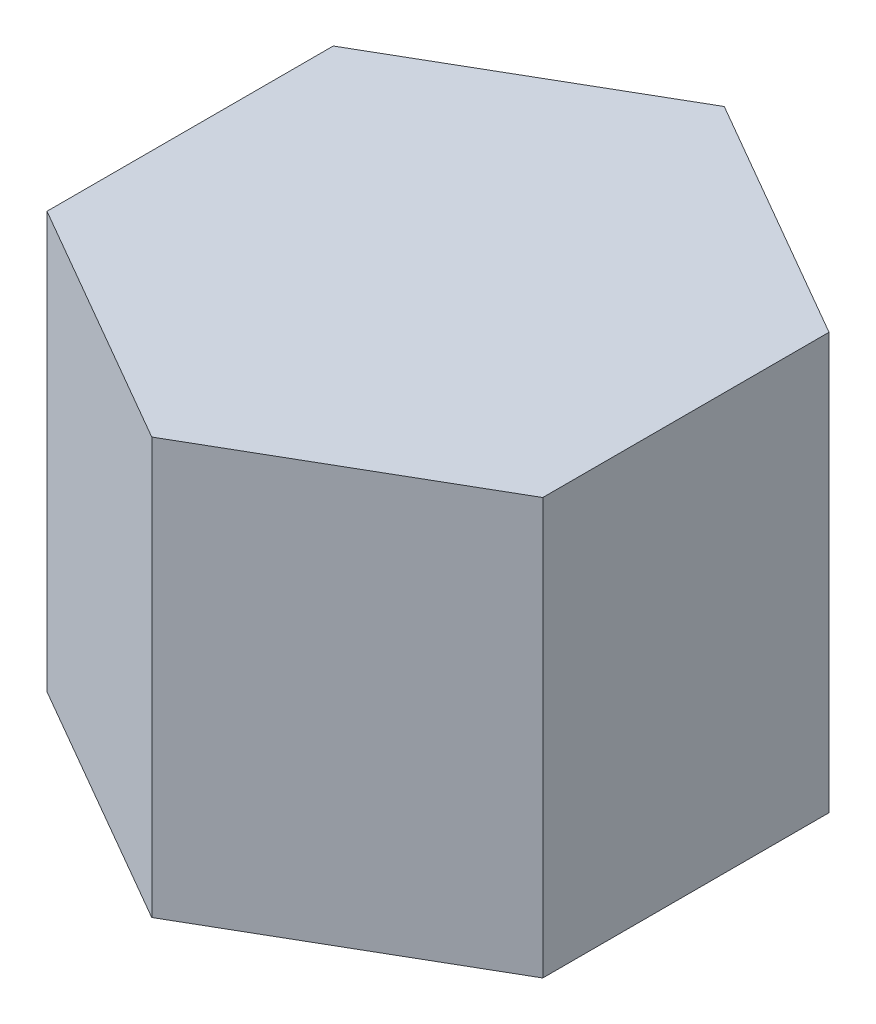
ISO-10303-21;
HEADER;
FILE_DESCRIPTION(('STEP AP214'),'2;1');
FILE_NAME('part.step','',(''),(''),'','','');
FILE_SCHEMA(('AUTOMOTIVE_DESIGN { 1 0 10303 214 1 1 1 1 }'));
ENDSEC;
DATA;
#1=APPLICATION_CONTEXT('core data for automotive mechanical design processes');
#2=APPLICATION_PROTOCOL_DEFINITION('international standard','automotive_design',2000,#1);
#3=PRODUCT_CONTEXT('',#1,'mechanical');
#4=PRODUCT('Part','Part','',(#3));
#5=PRODUCT_RELATED_PRODUCT_CATEGORY('part','',(#4));
#6=PRODUCT_DEFINITION_FORMATION('','',#4);
#7=PRODUCT_DEFINITION_CONTEXT('part definition',#1,'design');
#8=PRODUCT_DEFINITION('design','',#6,#7);
#9=PRODUCT_DEFINITION_SHAPE('','',#8);
#10=(LENGTH_UNIT() NAMED_UNIT(*) SI_UNIT(.MILLI.,.METRE.));
#11=(NAMED_UNIT(*) PLANE_ANGLE_UNIT() SI_UNIT($,.RADIAN.));
#12=(NAMED_UNIT(*) SI_UNIT($,.STERADIAN.) SOLID_ANGLE_UNIT());
#13=UNCERTAINTY_MEASURE_WITH_UNIT(LENGTH_MEASURE(1.E-05),#10,'distance_accuracy_value','');
#14=(GEOMETRIC_REPRESENTATION_CONTEXT(3) GLOBAL_UNCERTAINTY_ASSIGNED_CONTEXT((#13)) GLOBAL_UNIT_ASSIGNED_CONTEXT((#10,
#11,#12)) REPRESENTATION_CONTEXT('',''));
#15=CARTESIAN_POINT('',(0.,0.,0.));
#16=DIRECTION('',(0.,0.,1.));
#17=DIRECTION('',(1.,0.,0.));
#18=AXIS2_PLACEMENT_3D('',#15,#16,#17);
#19=CARTESIAN_POINT('',(210.839551417382,-147.556598747966,289.083895009141));
#20=DIRECTION('',(-0.499999999999978,0.,-0.866025403784452));
#21=DIRECTION('',(-0.866025403784452,0.,0.499999999999978));
#22=AXIS2_PLACEMENT_3D('',#19,#20,#21);
#23=PLANE('',#22);
#24=CARTESIAN_POINT('',(211.142660308706,-147.047793579175,288.908895009141));
#25=DIRECTION('',(-0.866025403784452,0.,0.499999999999978));
#26=VECTOR('',#25,1.);
#27=LINE('',#24,#26);
#28=CARTESIAN_POINT('',(211.142660308706,-147.047793579175,288.908895009141));
#29=VERTEX_POINT('',#28);
#30=CARTESIAN_POINT('',(210.839551417382,-147.047793579175,289.083895009141));
#31=VERTEX_POINT('',#30);
#32=EDGE_CURVE('E170',#29,#31,#27,.T.);
#33=ORIENTED_EDGE('',*,*,#32,.T.);
#34=CARTESIAN_POINT('',(210.839551417382,-147.556598747966,289.083895009141));
#35=DIRECTION('',(0.,1.,0.));
#36=VECTOR('',#35,1.);
#37=LINE('',#34,#36);
#38=CARTESIAN_POINT('',(210.839551417382,-147.556598747966,289.083895009141));
#39=VERTEX_POINT('',#38);
#40=EDGE_CURVE('E35',#39,#31,#37,.T.);
#41=ORIENTED_EDGE('',*,*,#40,.F.);
#42=CARTESIAN_POINT('',(211.142660308706,-147.556598747966,288.908895009141));
#43=DIRECTION('',(-0.866025403784452,0.,0.499999999999978));
#44=VECTOR('',#43,1.);
#45=LINE('',#42,#44);
#46=CARTESIAN_POINT('',(211.142660308706,-147.556598747966,288.908895009141));
#47=VERTEX_POINT('',#46);
#48=EDGE_CURVE('E159',#47,#39,#45,.T.);
#49=ORIENTED_EDGE('',*,*,#48,.F.);
#50=CARTESIAN_POINT('',(211.142660308706,-147.556598747966,288.908895009141));
#51=DIRECTION('',(0.,1.,0.));
#52=VECTOR('',#51,1.);
#53=LINE('',#50,#52);
#54=EDGE_CURVE('E10',#47,#29,#53,.T.);
#55=ORIENTED_EDGE('',*,*,#54,.T.);
#56=EDGE_LOOP('',(#33,#41,#49,#55));
#57=FACE_BOUND('',#56,.T.);
#58=ADVANCED_FACE('F16',(#57),#23,.F.);
#59=CARTESIAN_POINT('',(211.142660308706,-147.556598747966,291.594471220494));
#60=DIRECTION('',(-1.,0.,0.));
#61=DIRECTION('',(0.,-1.,0.));
#62=AXIS2_PLACEMENT_3D('',#59,#60,#61);
#63=PLANE('',#62);
#64=CARTESIAN_POINT('',(211.142660308706,-147.047793579175,288.558895009141));
#65=DIRECTION('',(0.,0.,1.));
#66=VECTOR('',#65,1.);
#67=LINE('',#64,#66);
#68=CARTESIAN_POINT('',(211.142660308706,-147.047793579175,288.558895009141));
#69=VERTEX_POINT('',#68);
#70=EDGE_CURVE('E167',#69,#29,#67,.T.);
#71=ORIENTED_EDGE('',*,*,#70,.T.);
#72=ORIENTED_EDGE('',*,*,#54,.F.);
#73=CARTESIAN_POINT('',(211.142660308706,-147.556598747966,288.558895009141));
#74=DIRECTION('',(0.,0.,1.));
#75=VECTOR('',#74,1.);
#76=LINE('',#73,#75);
#77=CARTESIAN_POINT('',(211.142660308706,-147.556598747966,288.558895009141));
#78=VERTEX_POINT('',#77);
#79=EDGE_CURVE('E156',#78,#47,#76,.T.);
#80=ORIENTED_EDGE('',*,*,#79,.F.);
#81=CARTESIAN_POINT('',(211.142660308706,-147.556598747966,288.558895009141));
#82=DIRECTION('',(0.,1.,0.));
#83=VECTOR('',#82,1.);
#84=LINE('',#81,#83);
#85=EDGE_CURVE('E27',#78,#69,#84,.T.);
#86=ORIENTED_EDGE('',*,*,#85,.T.);
#87=EDGE_LOOP('',(#71,#72,#80,#86));
#88=FACE_BOUND('',#87,.T.);
#89=ADVANCED_FACE('F189',(#88),#63,.F.);
#90=CARTESIAN_POINT('',(211.142660308706,-147.556598747966,288.558895009141));
#91=DIRECTION('',(-0.499999999999943,0.,0.866025403784471));
#92=DIRECTION('',(0.866025403784471,0.,0.499999999999943));
#93=AXIS2_PLACEMENT_3D('',#90,#91,#92);
#94=PLANE('',#93);
#95=CARTESIAN_POINT('',(210.839551417382,-147.047793579175,288.383895009141));
#96=DIRECTION('',(0.866025403784471,0.,0.499999999999943));
#97=VECTOR('',#96,1.);
#98=LINE('',#95,#97);
#99=CARTESIAN_POINT('',(210.839551417382,-147.047793579175,288.383895009141));
#100=VERTEX_POINT('',#99);
#101=EDGE_CURVE('E163',#100,#69,#98,.T.);
#102=ORIENTED_EDGE('',*,*,#101,.T.);
#103=ORIENTED_EDGE('',*,*,#85,.F.);
#104=CARTESIAN_POINT('',(210.839551417382,-147.556598747966,288.383895009141));
#105=DIRECTION('',(0.866025403784471,0.,0.499999999999943));
#106=VECTOR('',#105,1.);
#107=LINE('',#104,#106);
#108=CARTESIAN_POINT('',(210.839551417382,-147.556598747966,288.383895009141));
#109=VERTEX_POINT('',#108);
#110=EDGE_CURVE('E106',#109,#78,#107,.T.);
#111=ORIENTED_EDGE('',*,*,#110,.F.);
#112=CARTESIAN_POINT('',(210.839551417382,-147.556598747966,288.383895009141));
#113=DIRECTION('',(0.,1.,0.));
#114=VECTOR('',#113,1.);
#115=LINE('',#112,#114);
#116=EDGE_CURVE('E94',#109,#100,#115,.T.);
#117=ORIENTED_EDGE('',*,*,#116,.T.);
#118=EDGE_LOOP('',(#102,#103,#111,#117));
#119=FACE_BOUND('',#118,.T.);
#120=ADVANCED_FACE('F198',(#119),#94,.F.);
#121=CARTESIAN_POINT('',(210.839551417382,-147.556598747966,288.383895009141));
#122=DIRECTION('',(0.499999999999978,0.,0.866025403784452));
#123=DIRECTION('',(0.866025403784452,0.,-0.499999999999978));
#124=AXIS2_PLACEMENT_3D('',#121,#122,#123);
#125=PLANE('',#124);
#126=CARTESIAN_POINT('',(210.536442526057,-147.047793579175,288.558895009141));
#127=DIRECTION('',(0.866025403784452,0.,-0.499999999999978));
#128=VECTOR('',#127,1.);
#129=LINE('',#126,#128);
#130=CARTESIAN_POINT('',(210.536442526057,-147.047793579175,288.558895009141));
#131=VERTEX_POINT('',#130);
#132=EDGE_CURVE('E162',#131,#100,#129,.T.);
#133=ORIENTED_EDGE('',*,*,#132,.T.);
#134=ORIENTED_EDGE('',*,*,#116,.F.);
#135=CARTESIAN_POINT('',(210.536442526057,-147.556598747966,288.558895009141));
#136=DIRECTION('',(0.866025403784452,0.,-0.499999999999978));
#137=VECTOR('',#136,1.);
#138=LINE('',#135,#137);
#139=CARTESIAN_POINT('',(210.536442526057,-147.556598747966,288.558895009141));
#140=VERTEX_POINT('',#139);
#141=EDGE_CURVE('E98',#140,#109,#138,.T.);
#142=ORIENTED_EDGE('',*,*,#141,.F.);
#143=CARTESIAN_POINT('',(210.536442526057,-147.556598747966,288.558895009141));
#144=DIRECTION('',(0.,1.,0.));
#145=VECTOR('',#144,1.);
#146=LINE('',#143,#145);
#147=EDGE_CURVE('E79',#140,#131,#146,.T.);
#148=ORIENTED_EDGE('',*,*,#147,.T.);
#149=EDGE_LOOP('',(#133,#134,#142,#148));
#150=FACE_BOUND('',#149,.T.);
#151=ADVANCED_FACE('F100',(#150),#125,.F.);
#152=CARTESIAN_POINT('',(210.536442526057,-147.556598747966,291.594471220494));
#153=DIRECTION('',(1.,0.,0.));
#154=DIRECTION('',(0.,1.,0.));
#155=AXIS2_PLACEMENT_3D('',#152,#153,#154);
#156=PLANE('',#155);
#157=CARTESIAN_POINT('',(210.536442526057,-147.047793579175,288.908895009141));
#158=DIRECTION('',(0.,0.,-1.));
#159=VECTOR('',#158,1.);
#160=LINE('',#157,#159);
#161=CARTESIAN_POINT('',(210.536442526057,-147.047793579175,288.908895009141));
#162=VERTEX_POINT('',#161);
#163=EDGE_CURVE('E88',#162,#131,#160,.T.);
#164=ORIENTED_EDGE('',*,*,#163,.T.);
#165=ORIENTED_EDGE('',*,*,#147,.F.);
#166=CARTESIAN_POINT('',(210.536442526057,-147.556598747966,288.908895009141));
#167=DIRECTION('',(0.,0.,-1.));
#168=VECTOR('',#167,1.);
#169=LINE('',#166,#168);
#170=CARTESIAN_POINT('',(210.536442526057,-147.556598747966,288.908895009141));
#171=VERTEX_POINT('',#170);
#172=EDGE_CURVE('E84',#171,#140,#169,.T.);
#173=ORIENTED_EDGE('',*,*,#172,.F.);
#174=CARTESIAN_POINT('',(210.536442526057,-147.556598747966,288.908895009141));
#175=DIRECTION('',(0.,1.,0.));
#176=VECTOR('',#175,1.);
#177=LINE('',#174,#176);
#178=EDGE_CURVE('E58',#171,#162,#177,.T.);
#179=ORIENTED_EDGE('',*,*,#178,.T.);
#180=EDGE_LOOP('',(#164,#165,#173,#179));
#181=FACE_BOUND('',#180,.T.);
#182=ADVANCED_FACE('F82',(#181),#156,.F.);
#183=CARTESIAN_POINT('',(210.536442526057,-147.556598747966,288.908895009141));
#184=DIRECTION('',(0.499999999999943,0.,-0.866025403784471));
#185=DIRECTION('',(-0.866025403784471,0.,-0.499999999999943));
#186=AXIS2_PLACEMENT_3D('',#183,#184,#185);
#187=PLANE('',#186);
#188=CARTESIAN_POINT('',(210.839551417382,-147.047793579175,289.083895009141));
#189=DIRECTION('',(-0.866025403784471,0.,-0.499999999999943));
#190=VECTOR('',#189,1.);
#191=LINE('',#188,#190);
#192=EDGE_CURVE('E160',#31,#162,#191,.T.);
#193=ORIENTED_EDGE('',*,*,#192,.T.);
#194=ORIENTED_EDGE('',*,*,#178,.F.);
#195=CARTESIAN_POINT('',(210.839551417382,-147.556598747966,289.083895009141));
#196=DIRECTION('',(-0.866025403784471,0.,-0.499999999999943));
#197=VECTOR('',#196,1.);
#198=LINE('',#195,#197);
#199=EDGE_CURVE('E112',#39,#171,#198,.T.);
#200=ORIENTED_EDGE('',*,*,#199,.F.);
#201=ORIENTED_EDGE('',*,*,#40,.T.);
#202=EDGE_LOOP('',(#193,#194,#200,#201));
#203=FACE_BOUND('',#202,.T.);
#204=ADVANCED_FACE('F131',(#203),#187,.F.);
#205=CARTESIAN_POINT('',(206.491105863044,-147.556598747966,291.594471220494));
#206=DIRECTION('',(0.,1.,0.));
#207=DIRECTION('',(-1.,0.,0.));
#208=AXIS2_PLACEMENT_3D('',#205,#206,#207);
#209=PLANE('',#208);
#210=ORIENTED_EDGE('',*,*,#48,.T.);
#211=ORIENTED_EDGE('',*,*,#199,.T.);
#212=ORIENTED_EDGE('',*,*,#172,.T.);
#213=ORIENTED_EDGE('',*,*,#141,.T.);
#214=ORIENTED_EDGE('',*,*,#110,.T.);
#215=ORIENTED_EDGE('',*,*,#79,.T.);
#216=EDGE_LOOP('',(#210,#211,#212,#213,#214,#215));
#217=FACE_BOUND('',#216,.T.);
#218=ADVANCED_FACE('F111',(#217),#209,.F.);
#219=CARTESIAN_POINT('',(206.491105863044,-147.047793579175,291.594471220494));
#220=DIRECTION('',(0.,1.,0.));
#221=DIRECTION('',(-1.,0.,0.));
#222=AXIS2_PLACEMENT_3D('',#219,#220,#221);
#223=PLANE('',#222);
#224=ORIENTED_EDGE('',*,*,#32,.F.);
#225=ORIENTED_EDGE('',*,*,#70,.F.);
#226=ORIENTED_EDGE('',*,*,#101,.F.);
#227=ORIENTED_EDGE('',*,*,#132,.F.);
#228=ORIENTED_EDGE('',*,*,#163,.F.);
#229=ORIENTED_EDGE('',*,*,#192,.F.);
#230=EDGE_LOOP('',(#224,#225,#226,#227,#228,#229));
#231=FACE_BOUND('',#230,.T.);
#232=ADVANCED_FACE('F130',(#231),#223,.T.);
#233=CLOSED_SHELL('',(#58,#89,#120,#151,#182,#204,#218,#232));
#234=MANIFOLD_SOLID_BREP('B1',#233);
#235=ADVANCED_BREP_SHAPE_REPRESENTATION('',(#18,#234),#14);
#236=SHAPE_DEFINITION_REPRESENTATION(#9,#235);
ENDSEC;
END-ISO-10303-21;
